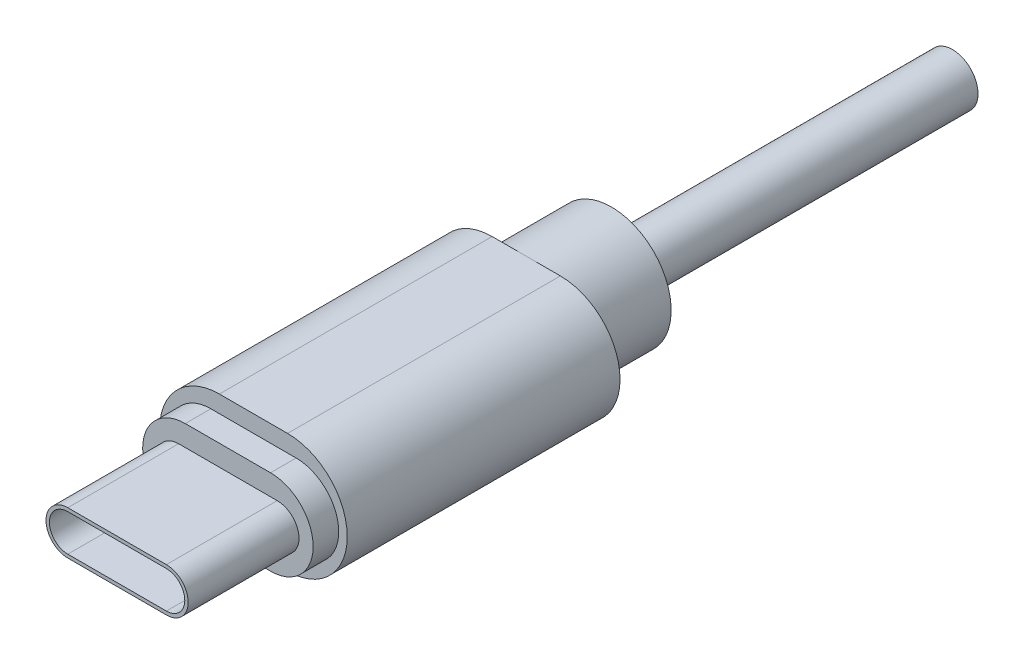
ISO-10303-21;
HEADER;
FILE_DESCRIPTION(('STEP AP214'),'2;1');
FILE_NAME('part.step','',(''),(''),'','','');
FILE_SCHEMA(('AUTOMOTIVE_DESIGN { 1 0 10303 214 1 1 1 1 }'));
ENDSEC;
DATA;
#1=APPLICATION_CONTEXT('core data for automotive mechanical design processes');
#2=APPLICATION_PROTOCOL_DEFINITION('international standard','automotive_design',2000,#1);
#3=PRODUCT_CONTEXT('',#1,'mechanical');
#4=PRODUCT('Part','Part','',(#3));
#5=PRODUCT_RELATED_PRODUCT_CATEGORY('part','',(#4));
#6=PRODUCT_DEFINITION_FORMATION('','',#4);
#7=PRODUCT_DEFINITION_CONTEXT('part definition',#1,'design');
#8=PRODUCT_DEFINITION('design','',#6,#7);
#9=PRODUCT_DEFINITION_SHAPE('','',#8);
#10=(LENGTH_UNIT() NAMED_UNIT(*) SI_UNIT(.MILLI.,.METRE.));
#11=(NAMED_UNIT(*) PLANE_ANGLE_UNIT() SI_UNIT($,.RADIAN.));
#12=(NAMED_UNIT(*) SI_UNIT($,.STERADIAN.) SOLID_ANGLE_UNIT());
#13=UNCERTAINTY_MEASURE_WITH_UNIT(LENGTH_MEASURE(1.E-05),#10,'distance_accuracy_value','');
#14=(GEOMETRIC_REPRESENTATION_CONTEXT(3) GLOBAL_UNCERTAINTY_ASSIGNED_CONTEXT((#13)) GLOBAL_UNIT_ASSIGNED_CONTEXT((#10,
#11,#12)) REPRESENTATION_CONTEXT('',''));
#15=CARTESIAN_POINT('',(0.,0.,0.));
#16=DIRECTION('',(0.,0.,1.));
#17=DIRECTION('',(1.,0.,0.));
#18=AXIS2_PLACEMENT_3D('',#15,#16,#17);
#19=CARTESIAN_POINT('',(0.,0.,-17.5));
#20=DIRECTION('',(0.,0.,-1.));
#21=DIRECTION('',(-1.,0.,0.));
#22=AXIS2_PLACEMENT_3D('',#19,#20,#21);
#23=CYLINDRICAL_SURFACE('',#22,1.5);
#24=CARTESIAN_POINT('',(0.,0.,-22.5));
#25=DIRECTION('',(0.,0.,-1.));
#26=DIRECTION('',(-1.,0.,0.));
#27=AXIS2_PLACEMENT_3D('',#24,#25,#26);
#28=CIRCLE('',#27,1.5);
#29=CARTESIAN_POINT('',(-1.5,0.,-22.5));
#30=VERTEX_POINT('',#29);
#31=EDGE_CURVE('E177',#30,#30,#28,.T.);
#32=ORIENTED_EDGE('',*,*,#31,.T.);
#33=EDGE_LOOP('',(#32));
#34=FACE_BOUND('',#33,.T.);
#35=CARTESIAN_POINT('',(0.,0.,-42.5));
#36=DIRECTION('',(0.,0.,-1.));
#37=DIRECTION('',(-1.,0.,0.));
#38=AXIS2_PLACEMENT_3D('',#35,#36,#37);
#39=CIRCLE('',#38,1.5);
#40=CARTESIAN_POINT('',(-1.5,0.,-42.5));
#41=VERTEX_POINT('',#40);
#42=EDGE_CURVE('E188',#41,#41,#39,.T.);
#43=ORIENTED_EDGE('',*,*,#42,.F.);
#44=EDGE_LOOP('',(#43));
#45=FACE_BOUND('',#44,.T.);
#46=ADVANCED_FACE('F36',(#34,#45),#23,.T.);
#47=CARTESIAN_POINT('',(2.,0.,-17.5));
#48=DIRECTION('',(0.,0.,1.));
#49=DIRECTION('',(1.,0.,0.));
#50=AXIS2_PLACEMENT_3D('',#47,#48,#49);
#51=PLANE('',#50);
#52=CARTESIAN_POINT('',(0.,0.,-17.5));
#53=DIRECTION('',(0.,0.,-1.));
#54=DIRECTION('',(-1.,0.,0.));
#55=AXIS2_PLACEMENT_3D('',#52,#53,#54);
#56=CIRCLE('',#55,3.5);
#57=CARTESIAN_POINT('',(0.,3.5,-17.5));
#58=VERTEX_POINT('',#57);
#59=CARTESIAN_POINT('',(0.,-3.5,-17.5));
#60=VERTEX_POINT('',#59);
#61=EDGE_CURVE('E47',#58,#60,#56,.T.);
#62=ORIENTED_EDGE('',*,*,#61,.F.);
#63=DIRECTION('',(-1.,0.,0.));
#64=VECTOR('',#63,1.);
#65=CARTESIAN_POINT('',(2.,3.5,-17.5));
#66=LINE('',#65,#64);
#67=CARTESIAN_POINT('',(2.,3.5,-17.5));
#68=VERTEX_POINT('',#67);
#69=EDGE_CURVE('E157',#68,#58,#66,.T.);
#70=ORIENTED_EDGE('',*,*,#69,.F.);
#71=CARTESIAN_POINT('',(2.,0.,-17.5));
#72=DIRECTION('',(0.,0.,1.));
#73=DIRECTION('',(1.,0.,0.));
#74=AXIS2_PLACEMENT_3D('',#71,#72,#73);
#75=CIRCLE('',#74,3.5);
#76=CARTESIAN_POINT('',(2.,-3.5,-17.5));
#77=VERTEX_POINT('',#76);
#78=EDGE_CURVE('E171',#77,#68,#75,.T.);
#79=ORIENTED_EDGE('',*,*,#78,.F.);
#80=DIRECTION('',(1.,0.,0.));
#81=VECTOR('',#80,1.);
#82=CARTESIAN_POINT('',(-2.,-3.5,-17.5));
#83=LINE('',#82,#81);
#84=EDGE_CURVE('E174',#60,#77,#83,.T.);
#85=ORIENTED_EDGE('',*,*,#84,.F.);
#86=EDGE_LOOP('',(#62,#70,#79,#85));
#87=FACE_BOUND('',#86,.T.);
#88=ADVANCED_FACE('F173',(#87),#51,.F.);
#89=CARTESIAN_POINT('',(2.5,0.,0.));
#90=DIRECTION('',(0.,0.,-1.));
#91=DIRECTION('',(-1.,0.,0.));
#92=AXIS2_PLACEMENT_3D('',#89,#90,#91);
#93=PLANE('',#92);
#94=CARTESIAN_POINT('',(2.5,0.,0.));
#95=DIRECTION('',(0.,0.,1.));
#96=DIRECTION('',(-1.,0.,0.));
#97=AXIS2_PLACEMENT_3D('',#94,#95,#96);
#98=CIRCLE('',#97,2.5);
#99=CARTESIAN_POINT('',(2.5,-2.5,0.));
#100=VERTEX_POINT('',#99);
#101=CARTESIAN_POINT('',(2.5,2.5,0.));
#102=VERTEX_POINT('',#101);
#103=EDGE_CURVE('E259',#100,#102,#98,.T.);
#104=ORIENTED_EDGE('',*,*,#103,.T.);
#105=DIRECTION('',(-1.,0.,0.));
#106=VECTOR('',#105,1.);
#107=CARTESIAN_POINT('',(-2.5,2.5,0.));
#108=LINE('',#107,#106);
#109=CARTESIAN_POINT('',(-2.5,2.5,0.));
#110=VERTEX_POINT('',#109);
#111=EDGE_CURVE('E262',#102,#110,#108,.T.);
#112=ORIENTED_EDGE('',*,*,#111,.T.);
#113=CARTESIAN_POINT('',(-2.5,0.,0.));
#114=DIRECTION('',(0.,0.,1.));
#115=DIRECTION('',(-1.,0.,0.));
#116=AXIS2_PLACEMENT_3D('',#113,#114,#115);
#117=CIRCLE('',#116,2.5);
#118=CARTESIAN_POINT('',(-2.5,-2.5,0.));
#119=VERTEX_POINT('',#118);
#120=EDGE_CURVE('E265',#110,#119,#117,.T.);
#121=ORIENTED_EDGE('',*,*,#120,.T.);
#122=DIRECTION('',(1.,0.,0.));
#123=VECTOR('',#122,1.);
#124=CARTESIAN_POINT('',(2.5,-2.5,0.));
#125=LINE('',#124,#123);
#126=EDGE_CURVE('E267',#119,#100,#125,.T.);
#127=ORIENTED_EDGE('',*,*,#126,.T.);
#128=EDGE_LOOP('',(#104,#112,#121,#127));
#129=FACE_BOUND('',#128,.T.);
#130=CARTESIAN_POINT('',(2.89,0.,0.));
#131=DIRECTION('',(0.,0.,1.));
#132=DIRECTION('',(-1.,0.,0.));
#133=AXIS2_PLACEMENT_3D('',#130,#131,#132);
#134=CIRCLE('',#133,1.28);
#135=CARTESIAN_POINT('',(2.89,-1.28,0.));
#136=VERTEX_POINT('',#135);
#137=CARTESIAN_POINT('',(2.89,1.28,0.));
#138=VERTEX_POINT('',#137);
#139=EDGE_CURVE('E220',#136,#138,#134,.T.);
#140=ORIENTED_EDGE('',*,*,#139,.F.);
#141=DIRECTION('',(1.,0.,0.));
#142=VECTOR('',#141,1.);
#143=CARTESIAN_POINT('',(2.89,-1.28,0.));
#144=LINE('',#143,#142);
#145=CARTESIAN_POINT('',(-2.89,-1.28,0.));
#146=VERTEX_POINT('',#145);
#147=EDGE_CURVE('E230',#146,#136,#144,.T.);
#148=ORIENTED_EDGE('',*,*,#147,.F.);
#149=CARTESIAN_POINT('',(-2.89,0.,0.));
#150=DIRECTION('',(0.,0.,1.));
#151=DIRECTION('',(-1.,0.,0.));
#152=AXIS2_PLACEMENT_3D('',#149,#150,#151);
#153=CIRCLE('',#152,1.28);
#154=CARTESIAN_POINT('',(-2.89,1.28,0.));
#155=VERTEX_POINT('',#154);
#156=EDGE_CURVE('E242',#155,#146,#153,.T.);
#157=ORIENTED_EDGE('',*,*,#156,.F.);
#158=DIRECTION('',(-1.,0.,0.));
#159=VECTOR('',#158,1.);
#160=CARTESIAN_POINT('',(-2.89,1.28,0.));
#161=LINE('',#160,#159);
#162=EDGE_CURVE('E239',#138,#155,#161,.T.);
#163=ORIENTED_EDGE('',*,*,#162,.F.);
#164=EDGE_LOOP('',(#140,#148,#157,#163));
#165=FACE_BOUND('',#164,.T.);
#166=ADVANCED_FACE('F334',(#129,#165),#93,.F.);
#167=CARTESIAN_POINT('',(2.,0.,-17.5));
#168=DIRECTION('',(0.,0.,1.));
#169=DIRECTION('',(1.,0.,0.));
#170=AXIS2_PLACEMENT_3D('',#167,#168,#169);
#171=CYLINDRICAL_SURFACE('',#170,3.5);
#172=CARTESIAN_POINT('',(2.,0.,-1.5));
#173=DIRECTION('',(0.,0.,1.));
#174=DIRECTION('',(1.,0.,0.));
#175=AXIS2_PLACEMENT_3D('',#172,#173,#174);
#176=CIRCLE('',#175,3.5);
#177=CARTESIAN_POINT('',(2.,-3.5,-1.5));
#178=VERTEX_POINT('',#177);
#179=CARTESIAN_POINT('',(2.,3.5,-1.5));
#180=VERTEX_POINT('',#179);
#181=EDGE_CURVE('E291',#178,#180,#176,.T.);
#182=ORIENTED_EDGE('',*,*,#181,.F.);
#183=DIRECTION('',(0.,0.,1.));
#184=VECTOR('',#183,1.);
#185=CARTESIAN_POINT('',(2.,-3.5,-17.5));
#186=LINE('',#185,#184);
#187=EDGE_CURVE('E45',#77,#178,#186,.T.);
#188=ORIENTED_EDGE('',*,*,#187,.F.);
#189=ORIENTED_EDGE('',*,*,#78,.T.);
#190=DIRECTION('',(0.,0.,1.));
#191=VECTOR('',#190,1.);
#192=CARTESIAN_POINT('',(2.,3.5,-17.5));
#193=LINE('',#192,#191);
#194=EDGE_CURVE('E40',#68,#180,#193,.T.);
#195=ORIENTED_EDGE('',*,*,#194,.T.);
#196=EDGE_LOOP('',(#182,#188,#189,#195));
#197=FACE_BOUND('',#196,.T.);
#198=ADVANCED_FACE('F38',(#197),#171,.T.);
#199=CARTESIAN_POINT('',(-2.,-3.5,-17.5));
#200=DIRECTION('',(0.,-1.,0.));
#201=DIRECTION('',(1.,0.,0.));
#202=AXIS2_PLACEMENT_3D('',#199,#200,#201);
#203=PLANE('',#202);
#204=DIRECTION('',(1.,0.,0.));
#205=VECTOR('',#204,1.);
#206=CARTESIAN_POINT('',(-2.,-3.5,-1.5));
#207=LINE('',#206,#205);
#208=CARTESIAN_POINT('',(-2.,-3.5,-1.5));
#209=VERTEX_POINT('',#208);
#210=EDGE_CURVE('E292',#209,#178,#207,.T.);
#211=ORIENTED_EDGE('',*,*,#210,.F.);
#212=DIRECTION('',(0.,0.,1.));
#213=VECTOR('',#212,1.);
#214=CARTESIAN_POINT('',(-2.,-3.5,-17.5));
#215=LINE('',#214,#213);
#216=CARTESIAN_POINT('',(-2.,-3.5,-17.5));
#217=VERTEX_POINT('',#216);
#218=EDGE_CURVE('E308',#217,#209,#215,.T.);
#219=ORIENTED_EDGE('',*,*,#218,.F.);
#220=EDGE_CURVE('E295',#217,#60,#83,.T.);
#221=ORIENTED_EDGE('',*,*,#220,.T.);
#222=ORIENTED_EDGE('',*,*,#84,.T.);
#223=ORIENTED_EDGE('',*,*,#187,.T.);
#224=EDGE_LOOP('',(#211,#219,#221,#222,#223));
#225=FACE_BOUND('',#224,.T.);
#226=ADVANCED_FACE('F318',(#225),#203,.T.);
#227=CARTESIAN_POINT('',(-2.,0.,-17.5));
#228=DIRECTION('',(0.,0.,1.));
#229=DIRECTION('',(1.,0.,0.));
#230=AXIS2_PLACEMENT_3D('',#227,#228,#229);
#231=CYLINDRICAL_SURFACE('',#230,3.5);
#232=CARTESIAN_POINT('',(-2.,0.,-1.5));
#233=DIRECTION('',(0.,0.,1.));
#234=DIRECTION('',(1.,0.,0.));
#235=AXIS2_PLACEMENT_3D('',#232,#233,#234);
#236=CIRCLE('',#235,3.5);
#237=CARTESIAN_POINT('',(-2.,3.5,-1.5));
#238=VERTEX_POINT('',#237);
#239=EDGE_CURVE('E302',#238,#209,#236,.T.);
#240=ORIENTED_EDGE('',*,*,#239,.F.);
#241=DIRECTION('',(0.,0.,1.));
#242=VECTOR('',#241,1.);
#243=CARTESIAN_POINT('',(-2.,3.5,-17.5));
#244=LINE('',#243,#242);
#245=CARTESIAN_POINT('',(-2.,3.5,-17.5));
#246=VERTEX_POINT('',#245);
#247=EDGE_CURVE('E309',#246,#238,#244,.T.);
#248=ORIENTED_EDGE('',*,*,#247,.F.);
#249=CARTESIAN_POINT('',(-2.,0.,-17.5));
#250=DIRECTION('',(0.,0.,1.));
#251=DIRECTION('',(1.,0.,0.));
#252=AXIS2_PLACEMENT_3D('',#249,#250,#251);
#253=CIRCLE('',#252,3.5);
#254=EDGE_CURVE('E166',#246,#217,#253,.T.);
#255=ORIENTED_EDGE('',*,*,#254,.T.);
#256=ORIENTED_EDGE('',*,*,#218,.T.);
#257=EDGE_LOOP('',(#240,#248,#255,#256));
#258=FACE_BOUND('',#257,.T.);
#259=ADVANCED_FACE('F320',(#258),#231,.T.);
#260=CARTESIAN_POINT('',(2.,3.5,-17.5));
#261=DIRECTION('',(0.,1.,0.));
#262=DIRECTION('',(-1.,0.,0.));
#263=AXIS2_PLACEMENT_3D('',#260,#261,#262);
#264=PLANE('',#263);
#265=DIRECTION('',(-1.,0.,0.));
#266=VECTOR('',#265,1.);
#267=CARTESIAN_POINT('',(2.,3.5,-1.5));
#268=LINE('',#267,#266);
#269=EDGE_CURVE('E299',#180,#238,#268,.T.);
#270=ORIENTED_EDGE('',*,*,#269,.F.);
#271=ORIENTED_EDGE('',*,*,#194,.F.);
#272=ORIENTED_EDGE('',*,*,#69,.T.);
#273=EDGE_CURVE('E160',#58,#246,#66,.T.);
#274=ORIENTED_EDGE('',*,*,#273,.T.);
#275=ORIENTED_EDGE('',*,*,#247,.T.);
#276=EDGE_LOOP('',(#270,#271,#272,#274,#275));
#277=FACE_BOUND('',#276,.T.);
#278=ADVANCED_FACE('F159',(#277),#264,.T.);
#279=EDGE_CURVE('E11',#60,#58,#56,.T.);
#280=ORIENTED_EDGE('',*,*,#279,.F.);
#281=ORIENTED_EDGE('',*,*,#220,.F.);
#282=ORIENTED_EDGE('',*,*,#254,.F.);
#283=ORIENTED_EDGE('',*,*,#273,.F.);
#284=EDGE_LOOP('',(#280,#281,#282,#283));
#285=FACE_BOUND('',#284,.T.);
#286=ADVANCED_FACE('F169',(#285),#51,.F.);
#287=CARTESIAN_POINT('',(2.,0.,-1.5));
#288=DIRECTION('',(0.,0.,1.));
#289=DIRECTION('',(1.,0.,0.));
#290=AXIS2_PLACEMENT_3D('',#287,#288,#289);
#291=PLANE('',#290);
#292=CARTESIAN_POINT('',(2.5,0.,-1.5));
#293=DIRECTION('',(0.,0.,1.));
#294=DIRECTION('',(-1.,0.,0.));
#295=AXIS2_PLACEMENT_3D('',#292,#293,#294);
#296=CIRCLE('',#295,2.5);
#297=CARTESIAN_POINT('',(2.5,-2.5,-1.5));
#298=VERTEX_POINT('',#297);
#299=CARTESIAN_POINT('',(2.5,2.5,-1.5));
#300=VERTEX_POINT('',#299);
#301=EDGE_CURVE('E258',#298,#300,#296,.T.);
#302=ORIENTED_EDGE('',*,*,#301,.F.);
#303=DIRECTION('',(1.,0.,0.));
#304=VECTOR('',#303,1.);
#305=CARTESIAN_POINT('',(2.5,-2.5,-1.5));
#306=LINE('',#305,#304);
#307=CARTESIAN_POINT('',(-2.5,-2.5,-1.5));
#308=VERTEX_POINT('',#307);
#309=EDGE_CURVE('E263',#308,#298,#306,.T.);
#310=ORIENTED_EDGE('',*,*,#309,.F.);
#311=CARTESIAN_POINT('',(-2.5,0.,-1.5));
#312=DIRECTION('',(0.,0.,1.));
#313=DIRECTION('',(-1.,0.,0.));
#314=AXIS2_PLACEMENT_3D('',#311,#312,#313);
#315=CIRCLE('',#314,2.5);
#316=CARTESIAN_POINT('',(-2.5,2.5,-1.5));
#317=VERTEX_POINT('',#316);
#318=EDGE_CURVE('E275',#317,#308,#315,.T.);
#319=ORIENTED_EDGE('',*,*,#318,.F.);
#320=DIRECTION('',(-1.,0.,0.));
#321=VECTOR('',#320,1.);
#322=CARTESIAN_POINT('',(-2.5,2.5,-1.5));
#323=LINE('',#322,#321);
#324=EDGE_CURVE('E272',#300,#317,#323,.T.);
#325=ORIENTED_EDGE('',*,*,#324,.F.);
#326=EDGE_LOOP('',(#302,#310,#319,#325));
#327=FACE_BOUND('',#326,.T.);
#328=ORIENTED_EDGE('',*,*,#181,.T.);
#329=ORIENTED_EDGE('',*,*,#269,.T.);
#330=ORIENTED_EDGE('',*,*,#239,.T.);
#331=ORIENTED_EDGE('',*,*,#210,.T.);
#332=EDGE_LOOP('',(#328,#329,#330,#331));
#333=FACE_BOUND('',#332,.T.);
#334=ADVANCED_FACE('F315',(#327,#333),#291,.T.);
#335=CARTESIAN_POINT('',(2.5,0.,0.));
#336=DIRECTION('',(0.,0.,-1.));
#337=DIRECTION('',(-1.,0.,0.));
#338=AXIS2_PLACEMENT_3D('',#335,#336,#337);
#339=CYLINDRICAL_SURFACE('',#338,2.5);
#340=ORIENTED_EDGE('',*,*,#301,.T.);
#341=DIRECTION('',(0.,0.,-1.));
#342=VECTOR('',#341,1.);
#343=CARTESIAN_POINT('',(2.5,2.5,0.));
#344=LINE('',#343,#342);
#345=EDGE_CURVE('E288',#102,#300,#344,.T.);
#346=ORIENTED_EDGE('',*,*,#345,.F.);
#347=ORIENTED_EDGE('',*,*,#103,.F.);
#348=DIRECTION('',(0.,0.,-1.));
#349=VECTOR('',#348,1.);
#350=CARTESIAN_POINT('',(2.5,-2.5,0.));
#351=LINE('',#350,#349);
#352=EDGE_CURVE('E269',#100,#298,#351,.T.);
#353=ORIENTED_EDGE('',*,*,#352,.T.);
#354=EDGE_LOOP('',(#340,#346,#347,#353));
#355=FACE_BOUND('',#354,.T.);
#356=ADVANCED_FACE('F392',(#355),#339,.T.);
#357=CARTESIAN_POINT('',(-2.5,2.5,0.));
#358=DIRECTION('',(0.,-1.,0.));
#359=DIRECTION('',(1.,0.,0.));
#360=AXIS2_PLACEMENT_3D('',#357,#358,#359);
#361=PLANE('',#360);
#362=ORIENTED_EDGE('',*,*,#324,.T.);
#363=DIRECTION('',(0.,0.,-1.));
#364=VECTOR('',#363,1.);
#365=CARTESIAN_POINT('',(-2.5,2.5,0.));
#366=LINE('',#365,#364);
#367=EDGE_CURVE('E285',#110,#317,#366,.T.);
#368=ORIENTED_EDGE('',*,*,#367,.F.);
#369=ORIENTED_EDGE('',*,*,#111,.F.);
#370=ORIENTED_EDGE('',*,*,#345,.T.);
#371=EDGE_LOOP('',(#362,#368,#369,#370));
#372=FACE_BOUND('',#371,.T.);
#373=ADVANCED_FACE('F388',(#372),#361,.F.);
#374=CARTESIAN_POINT('',(-2.5,0.,0.));
#375=DIRECTION('',(0.,0.,-1.));
#376=DIRECTION('',(-1.,0.,0.));
#377=AXIS2_PLACEMENT_3D('',#374,#375,#376);
#378=CYLINDRICAL_SURFACE('',#377,2.5);
#379=ORIENTED_EDGE('',*,*,#318,.T.);
#380=DIRECTION('',(0.,0.,-1.));
#381=VECTOR('',#380,1.);
#382=CARTESIAN_POINT('',(-2.5,-2.5,0.));
#383=LINE('',#382,#381);
#384=EDGE_CURVE('E282',#119,#308,#383,.T.);
#385=ORIENTED_EDGE('',*,*,#384,.F.);
#386=ORIENTED_EDGE('',*,*,#120,.F.);
#387=ORIENTED_EDGE('',*,*,#367,.T.);
#388=EDGE_LOOP('',(#379,#385,#386,#387));
#389=FACE_BOUND('',#388,.T.);
#390=ADVANCED_FACE('F384',(#389),#378,.T.);
#391=CARTESIAN_POINT('',(2.5,-2.5,0.));
#392=DIRECTION('',(0.,1.,0.));
#393=DIRECTION('',(0.,0.,1.));
#394=AXIS2_PLACEMENT_3D('',#391,#392,#393);
#395=PLANE('',#394);
#396=ORIENTED_EDGE('',*,*,#309,.T.);
#397=ORIENTED_EDGE('',*,*,#352,.F.);
#398=ORIENTED_EDGE('',*,*,#126,.F.);
#399=ORIENTED_EDGE('',*,*,#384,.T.);
#400=EDGE_LOOP('',(#396,#397,#398,#399));
#401=FACE_BOUND('',#400,.T.);
#402=ADVANCED_FACE('F377',(#401),#395,.F.);
#403=CARTESIAN_POINT('',(2.89,0.,6.5));
#404=DIRECTION('',(0.,0.,-1.));
#405=DIRECTION('',(-1.,0.,0.));
#406=AXIS2_PLACEMENT_3D('',#403,#404,#405);
#407=CYLINDRICAL_SURFACE('',#406,1.28);
#408=ORIENTED_EDGE('',*,*,#139,.T.);
#409=DIRECTION('',(0.,0.,-1.));
#410=VECTOR('',#409,1.);
#411=CARTESIAN_POINT('',(2.89,1.28,6.5));
#412=LINE('',#411,#410);
#413=CARTESIAN_POINT('',(2.89,1.28,6.5));
#414=VERTEX_POINT('',#413);
#415=EDGE_CURVE('E255',#414,#138,#412,.T.);
#416=ORIENTED_EDGE('',*,*,#415,.F.);
#417=CARTESIAN_POINT('',(2.89,0.,6.5));
#418=DIRECTION('',(0.,0.,1.));
#419=DIRECTION('',(-1.,0.,0.));
#420=AXIS2_PLACEMENT_3D('',#417,#418,#419);
#421=CIRCLE('',#420,1.28);
#422=CARTESIAN_POINT('',(2.89,-1.28,6.5));
#423=VERTEX_POINT('',#422);
#424=EDGE_CURVE('E226',#423,#414,#421,.T.);
#425=ORIENTED_EDGE('',*,*,#424,.F.);
#426=DIRECTION('',(0.,0.,-1.));
#427=VECTOR('',#426,1.);
#428=CARTESIAN_POINT('',(2.89,-1.28,6.5));
#429=LINE('',#428,#427);
#430=EDGE_CURVE('E236',#423,#136,#429,.T.);
#431=ORIENTED_EDGE('',*,*,#430,.T.);
#432=EDGE_LOOP('',(#408,#416,#425,#431));
#433=FACE_BOUND('',#432,.T.);
#434=ADVANCED_FACE('F373',(#433),#407,.T.);
#435=CARTESIAN_POINT('',(-2.89,1.28,6.5));
#436=DIRECTION('',(0.,-1.,0.));
#437=DIRECTION('',(0.,0.,-1.));
#438=AXIS2_PLACEMENT_3D('',#435,#436,#437);
#439=PLANE('',#438);
#440=ORIENTED_EDGE('',*,*,#162,.T.);
#441=DIRECTION('',(0.,0.,-1.));
#442=VECTOR('',#441,1.);
#443=CARTESIAN_POINT('',(-2.89,1.28,6.5));
#444=LINE('',#443,#442);
#445=CARTESIAN_POINT('',(-2.89,1.28,6.5));
#446=VERTEX_POINT('',#445);
#447=EDGE_CURVE('E252',#446,#155,#444,.T.);
#448=ORIENTED_EDGE('',*,*,#447,.F.);
#449=DIRECTION('',(-1.,0.,0.));
#450=VECTOR('',#449,1.);
#451=CARTESIAN_POINT('',(-2.89,1.28,6.5));
#452=LINE('',#451,#450);
#453=EDGE_CURVE('E229',#414,#446,#452,.T.);
#454=ORIENTED_EDGE('',*,*,#453,.F.);
#455=ORIENTED_EDGE('',*,*,#415,.T.);
#456=EDGE_LOOP('',(#440,#448,#454,#455));
#457=FACE_BOUND('',#456,.T.);
#458=ADVANCED_FACE('F369',(#457),#439,.F.);
#459=CARTESIAN_POINT('',(-2.89,0.,6.5));
#460=DIRECTION('',(0.,0.,-1.));
#461=DIRECTION('',(-1.,0.,0.));
#462=AXIS2_PLACEMENT_3D('',#459,#460,#461);
#463=CYLINDRICAL_SURFACE('',#462,1.28);
#464=ORIENTED_EDGE('',*,*,#156,.T.);
#465=DIRECTION('',(0.,0.,-1.));
#466=VECTOR('',#465,1.);
#467=CARTESIAN_POINT('',(-2.89,-1.28,6.5));
#468=LINE('',#467,#466);
#469=CARTESIAN_POINT('',(-2.89,-1.28,6.5));
#470=VERTEX_POINT('',#469);
#471=EDGE_CURVE('E249',#470,#146,#468,.T.);
#472=ORIENTED_EDGE('',*,*,#471,.F.);
#473=CARTESIAN_POINT('',(-2.89,0.,6.5));
#474=DIRECTION('',(0.,0.,1.));
#475=DIRECTION('',(-1.,0.,0.));
#476=AXIS2_PLACEMENT_3D('',#473,#474,#475);
#477=CIRCLE('',#476,1.28);
#478=EDGE_CURVE('E232',#446,#470,#477,.T.);
#479=ORIENTED_EDGE('',*,*,#478,.F.);
#480=ORIENTED_EDGE('',*,*,#447,.T.);
#481=EDGE_LOOP('',(#464,#472,#479,#480));
#482=FACE_BOUND('',#481,.T.);
#483=ADVANCED_FACE('F365',(#482),#463,.T.);
#484=CARTESIAN_POINT('',(2.89,-1.28,6.5));
#485=DIRECTION('',(0.,1.,0.));
#486=DIRECTION('',(0.,0.,1.));
#487=AXIS2_PLACEMENT_3D('',#484,#485,#486);
#488=PLANE('',#487);
#489=ORIENTED_EDGE('',*,*,#147,.T.);
#490=ORIENTED_EDGE('',*,*,#430,.F.);
#491=DIRECTION('',(1.,0.,0.));
#492=VECTOR('',#491,1.);
#493=CARTESIAN_POINT('',(2.89,-1.28,6.5));
#494=LINE('',#493,#492);
#495=EDGE_CURVE('E234',#470,#423,#494,.T.);
#496=ORIENTED_EDGE('',*,*,#495,.F.);
#497=ORIENTED_EDGE('',*,*,#471,.T.);
#498=EDGE_LOOP('',(#489,#490,#496,#497));
#499=FACE_BOUND('',#498,.T.);
#500=ADVANCED_FACE('F361',(#499),#488,.F.);
#501=CARTESIAN_POINT('',(2.89,0.,6.5));
#502=DIRECTION('',(0.,0.,-1.));
#503=DIRECTION('',(-1.,0.,0.));
#504=AXIS2_PLACEMENT_3D('',#501,#502,#503);
#505=PLANE('',#504);
#506=DIRECTION('',(-1.,0.,0.));
#507=VECTOR('',#506,1.);
#508=CARTESIAN_POINT('',(2.89,1.08,6.5));
#509=LINE('',#508,#507);
#510=CARTESIAN_POINT('',(2.89,1.08,6.5));
#511=VERTEX_POINT('',#510);
#512=CARTESIAN_POINT('',(-2.89,1.08,6.5));
#513=VERTEX_POINT('',#512);
#514=EDGE_CURVE('E210',#511,#513,#509,.T.);
#515=ORIENTED_EDGE('',*,*,#514,.F.);
#516=CARTESIAN_POINT('',(2.89,0.,6.5));
#517=DIRECTION('',(0.,0.,1.));
#518=DIRECTION('',(1.,0.,0.));
#519=AXIS2_PLACEMENT_3D('',#516,#517,#518);
#520=CIRCLE('',#519,1.08);
#521=CARTESIAN_POINT('',(2.89,-1.08,6.5));
#522=VERTEX_POINT('',#521);
#523=EDGE_CURVE('E60',#522,#511,#520,.T.);
#524=ORIENTED_EDGE('',*,*,#523,.F.);
#525=DIRECTION('',(1.,0.,0.));
#526=VECTOR('',#525,1.);
#527=CARTESIAN_POINT('',(-2.89,-1.08,6.5));
#528=LINE('',#527,#526);
#529=CARTESIAN_POINT('',(-2.89,-1.08,6.5));
#530=VERTEX_POINT('',#529);
#531=EDGE_CURVE('E199',#530,#522,#528,.T.);
#532=ORIENTED_EDGE('',*,*,#531,.F.);
#533=CARTESIAN_POINT('',(-2.89,0.,6.5));
#534=DIRECTION('',(0.,0.,1.));
#535=DIRECTION('',(1.,0.,0.));
#536=AXIS2_PLACEMENT_3D('',#533,#534,#535);
#537=CIRCLE('',#536,1.08);
#538=EDGE_CURVE('E213',#513,#530,#537,.T.);
#539=ORIENTED_EDGE('',*,*,#538,.F.);
#540=EDGE_LOOP('',(#515,#524,#532,#539));
#541=FACE_BOUND('',#540,.T.);
#542=ORIENTED_EDGE('',*,*,#424,.T.);
#543=ORIENTED_EDGE('',*,*,#453,.T.);
#544=ORIENTED_EDGE('',*,*,#478,.T.);
#545=ORIENTED_EDGE('',*,*,#495,.T.);
#546=EDGE_LOOP('',(#542,#543,#544,#545));
#547=FACE_BOUND('',#546,.T.);
#548=ADVANCED_FACE('F358',(#541,#547),#505,.F.);
#549=CARTESIAN_POINT('',(2.89,0.,0.2));
#550=DIRECTION('',(0.,0.,1.));
#551=DIRECTION('',(1.,0.,0.));
#552=AXIS2_PLACEMENT_3D('',#549,#550,#551);
#553=CYLINDRICAL_SURFACE('',#552,1.08);
#554=ORIENTED_EDGE('',*,*,#523,.T.);
#555=DIRECTION('',(0.,0.,1.));
#556=VECTOR('',#555,1.);
#557=CARTESIAN_POINT('',(2.89,1.08,0.2));
#558=LINE('',#557,#556);
#559=CARTESIAN_POINT('',(2.89,1.08,0.2));
#560=VERTEX_POINT('',#559);
#561=EDGE_CURVE('E208',#560,#511,#558,.T.);
#562=ORIENTED_EDGE('',*,*,#561,.F.);
#563=CARTESIAN_POINT('',(2.89,0.,0.2));
#564=DIRECTION('',(0.,0.,1.));
#565=DIRECTION('',(1.,0.,0.));
#566=AXIS2_PLACEMENT_3D('',#563,#564,#565);
#567=CIRCLE('',#566,1.08);
#568=CARTESIAN_POINT('',(2.89,-1.08,0.2));
#569=VERTEX_POINT('',#568);
#570=EDGE_CURVE('E195',#569,#560,#567,.T.);
#571=ORIENTED_EDGE('',*,*,#570,.F.);
#572=DIRECTION('',(0.,0.,1.));
#573=VECTOR('',#572,1.);
#574=CARTESIAN_POINT('',(2.89,-1.08,0.2));
#575=LINE('',#574,#573);
#576=EDGE_CURVE('E218',#569,#522,#575,.T.);
#577=ORIENTED_EDGE('',*,*,#576,.T.);
#578=EDGE_LOOP('',(#554,#562,#571,#577));
#579=FACE_BOUND('',#578,.T.);
#580=ADVANCED_FACE('F348',(#579),#553,.F.);
#581=CARTESIAN_POINT('',(-2.89,-1.08,0.2));
#582=DIRECTION('',(0.,-1.,0.));
#583=DIRECTION('',(0.,0.,-1.));
#584=AXIS2_PLACEMENT_3D('',#581,#582,#583);
#585=PLANE('',#584);
#586=ORIENTED_EDGE('',*,*,#531,.T.);
#587=ORIENTED_EDGE('',*,*,#576,.F.);
#588=DIRECTION('',(1.,0.,0.));
#589=VECTOR('',#588,1.);
#590=CARTESIAN_POINT('',(-2.89,-1.08,0.2));
#591=LINE('',#590,#589);
#592=CARTESIAN_POINT('',(-2.89,-1.08,0.2));
#593=VERTEX_POINT('',#592);
#594=EDGE_CURVE('E205',#593,#569,#591,.T.);
#595=ORIENTED_EDGE('',*,*,#594,.F.);
#596=DIRECTION('',(0.,0.,1.));
#597=VECTOR('',#596,1.);
#598=CARTESIAN_POINT('',(-2.89,-1.08,0.2));
#599=LINE('',#598,#597);
#600=EDGE_CURVE('E221',#593,#530,#599,.T.);
#601=ORIENTED_EDGE('',*,*,#600,.T.);
#602=EDGE_LOOP('',(#586,#587,#595,#601));
#603=FACE_BOUND('',#602,.T.);
#604=ADVANCED_FACE('F344',(#603),#585,.F.);
#605=CARTESIAN_POINT('',(-2.89,0.,0.2));
#606=DIRECTION('',(0.,0.,1.));
#607=DIRECTION('',(1.,0.,0.));
#608=AXIS2_PLACEMENT_3D('',#605,#606,#607);
#609=CYLINDRICAL_SURFACE('',#608,1.08);
#610=ORIENTED_EDGE('',*,*,#538,.T.);
#611=ORIENTED_EDGE('',*,*,#600,.F.);
#612=CARTESIAN_POINT('',(-2.89,0.,0.2));
#613=DIRECTION('',(0.,0.,1.));
#614=DIRECTION('',(1.,0.,0.));
#615=AXIS2_PLACEMENT_3D('',#612,#613,#614);
#616=CIRCLE('',#615,1.08);
#617=CARTESIAN_POINT('',(-2.89,1.08,0.2));
#618=VERTEX_POINT('',#617);
#619=EDGE_CURVE('E202',#618,#593,#616,.T.);
#620=ORIENTED_EDGE('',*,*,#619,.F.);
#621=DIRECTION('',(0.,0.,1.));
#622=VECTOR('',#621,1.);
#623=CARTESIAN_POINT('',(-2.89,1.08,0.2));
#624=LINE('',#623,#622);
#625=EDGE_CURVE('E223',#618,#513,#624,.T.);
#626=ORIENTED_EDGE('',*,*,#625,.T.);
#627=EDGE_LOOP('',(#610,#611,#620,#626));
#628=FACE_BOUND('',#627,.T.);
#629=ADVANCED_FACE('F347',(#628),#609,.F.);
#630=CARTESIAN_POINT('',(2.89,1.08,0.2));
#631=DIRECTION('',(0.,1.,0.));
#632=DIRECTION('',(0.,0.,1.));
#633=AXIS2_PLACEMENT_3D('',#630,#631,#632);
#634=PLANE('',#633);
#635=ORIENTED_EDGE('',*,*,#514,.T.);
#636=ORIENTED_EDGE('',*,*,#625,.F.);
#637=DIRECTION('',(-1.,0.,0.));
#638=VECTOR('',#637,1.);
#639=CARTESIAN_POINT('',(2.89,1.08,0.2));
#640=LINE('',#639,#638);
#641=EDGE_CURVE('E198',#560,#618,#640,.T.);
#642=ORIENTED_EDGE('',*,*,#641,.F.);
#643=ORIENTED_EDGE('',*,*,#561,.T.);
#644=EDGE_LOOP('',(#635,#636,#642,#643));
#645=FACE_BOUND('',#644,.T.);
#646=ADVANCED_FACE('F342',(#645),#634,.F.);
#647=CARTESIAN_POINT('',(2.89,0.,0.2));
#648=DIRECTION('',(0.,0.,1.));
#649=DIRECTION('',(1.,0.,0.));
#650=AXIS2_PLACEMENT_3D('',#647,#648,#649);
#651=PLANE('',#650);
#652=ORIENTED_EDGE('',*,*,#570,.T.);
#653=ORIENTED_EDGE('',*,*,#641,.T.);
#654=ORIENTED_EDGE('',*,*,#619,.T.);
#655=ORIENTED_EDGE('',*,*,#594,.T.);
#656=EDGE_LOOP('',(#652,#653,#654,#655));
#657=FACE_BOUND('',#656,.T.);
#658=ADVANCED_FACE('F182',(#657),#651,.T.);
#659=CARTESIAN_POINT('',(0.,0.,-17.5));
#660=DIRECTION('',(0.,0.,-1.));
#661=DIRECTION('',(-1.,0.,0.));
#662=AXIS2_PLACEMENT_3D('',#659,#660,#661);
#663=CYLINDRICAL_SURFACE('',#662,3.5);
#664=ORIENTED_EDGE('',*,*,#61,.T.);
#665=ORIENTED_EDGE('',*,*,#279,.T.);
#666=EDGE_LOOP('',(#664,#665));
#667=FACE_BOUND('',#666,.T.);
#668=CARTESIAN_POINT('',(0.,0.,-22.5));
#669=DIRECTION('',(0.,0.,-1.));
#670=DIRECTION('',(-1.,0.,0.));
#671=AXIS2_PLACEMENT_3D('',#668,#669,#670);
#672=CIRCLE('',#671,3.5);
#673=CARTESIAN_POINT('',(-3.5,0.,-22.5));
#674=VERTEX_POINT('',#673);
#675=EDGE_CURVE('E186',#674,#674,#672,.T.);
#676=ORIENTED_EDGE('',*,*,#675,.F.);
#677=EDGE_LOOP('',(#676));
#678=FACE_BOUND('',#677,.T.);
#679=ADVANCED_FACE('F178',(#667,#678),#663,.T.);
#680=CARTESIAN_POINT('',(1.5,0.,-22.5));
#681=DIRECTION('',(0.,0.,-1.));
#682=DIRECTION('',(-1.,0.,0.));
#683=AXIS2_PLACEMENT_3D('',#680,#681,#682);
#684=PLANE('',#683);
#685=ORIENTED_EDGE('',*,*,#675,.T.);
#686=EDGE_LOOP('',(#685));
#687=FACE_BOUND('',#686,.T.);
#688=ORIENTED_EDGE('',*,*,#31,.F.);
#689=EDGE_LOOP('',(#688));
#690=FACE_BOUND('',#689,.T.);
#691=ADVANCED_FACE('F181',(#687,#690),#684,.T.);
#692=CARTESIAN_POINT('',(0.,0.,-42.5));
#693=DIRECTION('',(0.,0.,-1.));
#694=DIRECTION('',(-1.,0.,0.));
#695=AXIS2_PLACEMENT_3D('',#692,#693,#694);
#696=PLANE('',#695);
#697=ORIENTED_EDGE('',*,*,#42,.T.);
#698=EDGE_LOOP('',(#697));
#699=FACE_BOUND('',#698,.T.);
#700=ADVANCED_FACE('F488',(#699),#696,.T.);
#701=CLOSED_SHELL('',(#46,#88,#166,#198,#226,#259,#278,#286,#334,#356,#373,#390,#402,#434,#458,
#483,#500,#548,#580,#604,#629,#646,#658,#679,#691,#700));
#702=MANIFOLD_SOLID_BREP('B2',#701);
#703=ADVANCED_BREP_SHAPE_REPRESENTATION('',(#18,#702),#14);
#704=SHAPE_DEFINITION_REPRESENTATION(#9,#703);
ENDSEC;
END-ISO-10303-21;
